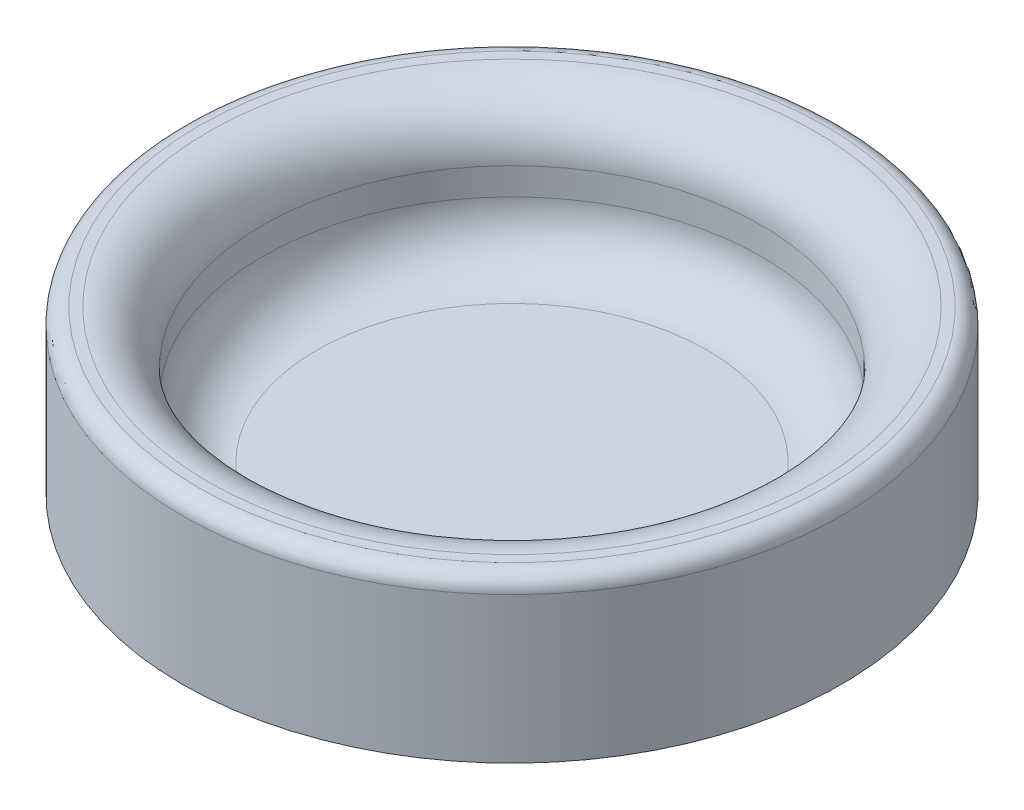
ISO-10303-21;
HEADER;
FILE_DESCRIPTION(('STEP AP214'),'2;1');
FILE_NAME('part.step','',(''),(''),'','','');
FILE_SCHEMA(('AUTOMOTIVE_DESIGN { 1 0 10303 214 1 1 1 1 }'));
ENDSEC;
DATA;
#1=APPLICATION_CONTEXT('core data for automotive mechanical design processes');
#2=APPLICATION_PROTOCOL_DEFINITION('international standard','automotive_design',2000,#1);
#3=PRODUCT_CONTEXT('',#1,'mechanical');
#4=PRODUCT('Part','Part','',(#3));
#5=PRODUCT_RELATED_PRODUCT_CATEGORY('part','',(#4));
#6=PRODUCT_DEFINITION_FORMATION('','',#4);
#7=PRODUCT_DEFINITION_CONTEXT('part definition',#1,'design');
#8=PRODUCT_DEFINITION('design','',#6,#7);
#9=PRODUCT_DEFINITION_SHAPE('','',#8);
#10=(LENGTH_UNIT() NAMED_UNIT(*) SI_UNIT(.MILLI.,.METRE.));
#11=(NAMED_UNIT(*) PLANE_ANGLE_UNIT() SI_UNIT($,.RADIAN.));
#12=(NAMED_UNIT(*) SI_UNIT($,.STERADIAN.) SOLID_ANGLE_UNIT());
#13=UNCERTAINTY_MEASURE_WITH_UNIT(LENGTH_MEASURE(1.E-05),#10,'distance_accuracy_value','');
#14=(GEOMETRIC_REPRESENTATION_CONTEXT(3) GLOBAL_UNCERTAINTY_ASSIGNED_CONTEXT((#13)) GLOBAL_UNIT_ASSIGNED_CONTEXT((#10,
#11,#12)) REPRESENTATION_CONTEXT('',''));
#15=CARTESIAN_POINT('',(0.,0.,0.));
#16=DIRECTION('',(0.,0.,1.));
#17=DIRECTION('',(1.,0.,0.));
#18=AXIS2_PLACEMENT_3D('',#15,#16,#17);
#19=CARTESIAN_POINT('',(-18.5585838996368,5.,-19.0375150970468));
#20=DIRECTION('',(0.,-1.,0.));
#21=DIRECTION('',(0.,0.,-1.));
#22=AXIS2_PLACEMENT_3D('',#19,#20,#21);
#23=CYLINDRICAL_SURFACE('',#22,60.9579895338705);
#24=CARTESIAN_POINT('',(-18.5585838996368,27.,-19.0375150970468));
#25=DIRECTION('',(0.,1.,0.));
#26=DIRECTION('',(0.,0.,1.));
#27=AXIS2_PLACEMENT_3D('',#24,#25,#26);
#28=CIRCLE('',#27,60.9579895338705);
#29=CARTESIAN_POINT('',(-18.5585838996368,27.,41.9204744368237));
#30=VERTEX_POINT('',#29);
#31=EDGE_CURVE('E11',#30,#30,#28,.F.);
#32=ORIENTED_EDGE('',*,*,#31,.T.);
#33=EDGE_LOOP('',(#32));
#34=FACE_BOUND('',#33,.T.);
#35=CARTESIAN_POINT('',(-18.5585838996368,0.,-19.0375150970468));
#36=DIRECTION('',(0.,1.,0.));
#37=DIRECTION('',(0.,0.,1.));
#38=AXIS2_PLACEMENT_3D('',#35,#36,#37);
#39=CIRCLE('',#38,60.9579895338705);
#40=CARTESIAN_POINT('',(-18.5585838996368,0.,41.9204744368237));
#41=VERTEX_POINT('',#40);
#42=EDGE_CURVE('E69',#41,#41,#39,.T.);
#43=ORIENTED_EDGE('',*,*,#42,.T.);
#44=EDGE_LOOP('',(#43));
#45=FACE_BOUND('',#44,.T.);
#46=ADVANCED_FACE('F43',(#34,#45),#23,.T.);
#47=CARTESIAN_POINT('',(0.,0.,0.));
#48=DIRECTION('',(0.,1.,0.));
#49=DIRECTION('',(0.,0.,1.));
#50=AXIS2_PLACEMENT_3D('',#47,#48,#49);
#51=PLANE('',#50);
#52=ORIENTED_EDGE('',*,*,#42,.F.);
#53=EDGE_LOOP('',(#52));
#54=FACE_BOUND('',#53,.T.);
#55=ADVANCED_FACE('F74',(#54),#51,.F.);
#56=CARTESIAN_POINT('',(-18.5585838996368,30.,-19.0375150970468));
#57=DIRECTION('',(0.,1.,0.));
#58=DIRECTION('',(0.,0.,1.));
#59=AXIS2_PLACEMENT_3D('',#56,#57,#58);
#60=PLANE('',#59);
#61=CARTESIAN_POINT('',(-18.5585838996368,30.,-19.0375150970468));
#62=DIRECTION('',(0.,1.,0.));
#63=DIRECTION('',(0.,0.,1.));
#64=AXIS2_PLACEMENT_3D('',#61,#62,#63);
#65=CIRCLE('',#64,57.9579895338705);
#66=CARTESIAN_POINT('',(-18.5585838996368,30.,38.9204744368237));
#67=VERTEX_POINT('',#66);
#68=EDGE_CURVE('E50',#67,#67,#65,.T.);
#69=ORIENTED_EDGE('',*,*,#68,.T.);
#70=EDGE_LOOP('',(#69));
#71=FACE_BOUND('',#70,.T.);
#72=CARTESIAN_POINT('',(-18.5585838996368,30.,-19.0375150970468));
#73=DIRECTION('',(0.,1.,0.));
#74=DIRECTION('',(0.,0.,1.));
#75=AXIS2_PLACEMENT_3D('',#72,#73,#74);
#76=CIRCLE('',#75,56.1321013405474);
#77=CARTESIAN_POINT('',(-18.5585838996368,30.,37.0945862435005));
#78=VERTEX_POINT('',#77);
#79=EDGE_CURVE('E54',#78,#78,#76,.F.);
#80=ORIENTED_EDGE('',*,*,#79,.T.);
#81=EDGE_LOOP('',(#80));
#82=FACE_BOUND('',#81,.T.);
#83=ADVANCED_FACE('F76',(#71,#82),#60,.T.);
#84=CARTESIAN_POINT('',(-18.5585838996368,30.,-19.0375150970468));
#85=DIRECTION('',(0.,-1.,0.));
#86=DIRECTION('',(0.,0.,-1.));
#87=AXIS2_PLACEMENT_3D('',#84,#85,#86);
#88=CYLINDRICAL_SURFACE('',#87,46.1321013405474);
#89=CARTESIAN_POINT('',(-18.5585838996368,20.,-19.0375150970468));
#90=DIRECTION('',(0.,1.,0.));
#91=DIRECTION('',(0.,0.,1.));
#92=AXIS2_PLACEMENT_3D('',#89,#90,#91);
#93=CIRCLE('',#92,46.1321013405474);
#94=CARTESIAN_POINT('',(-18.5585838996368,20.,27.0945862435005));
#95=VERTEX_POINT('',#94);
#96=EDGE_CURVE('E58',#95,#95,#93,.T.);
#97=ORIENTED_EDGE('',*,*,#96,.T.);
#98=EDGE_LOOP('',(#97));
#99=FACE_BOUND('',#98,.T.);
#100=CARTESIAN_POINT('',(-18.5585838996368,15.,-19.0375150970468));
#101=DIRECTION('',(0.,1.,0.));
#102=DIRECTION('',(0.,0.,1.));
#103=AXIS2_PLACEMENT_3D('',#100,#101,#102);
#104=CIRCLE('',#103,46.1321013405474);
#105=CARTESIAN_POINT('',(-18.5585838996368,15.,27.0945862435005));
#106=VERTEX_POINT('',#105);
#107=EDGE_CURVE('E66',#106,#106,#104,.F.);
#108=ORIENTED_EDGE('',*,*,#107,.T.);
#109=EDGE_LOOP('',(#108));
#110=FACE_BOUND('',#109,.T.);
#111=ADVANCED_FACE('F82',(#99,#110),#88,.F.);
#112=CARTESIAN_POINT('',(0.,5.,0.));
#113=DIRECTION('',(0.,1.,0.));
#114=DIRECTION('',(0.,0.,1.));
#115=AXIS2_PLACEMENT_3D('',#112,#113,#114);
#116=PLANE('',#115);
#117=CARTESIAN_POINT('',(-18.5585838996368,5.,-19.0375150970468));
#118=DIRECTION('',(0.,1.,0.));
#119=DIRECTION('',(0.,0.,1.));
#120=AXIS2_PLACEMENT_3D('',#117,#118,#119);
#121=CIRCLE('',#120,36.1321013405473);
#122=CARTESIAN_POINT('',(-18.5585838996368,5.,17.0945862435005));
#123=VERTEX_POINT('',#122);
#124=EDGE_CURVE('E63',#123,#123,#121,.T.);
#125=ORIENTED_EDGE('',*,*,#124,.T.);
#126=EDGE_LOOP('',(#125));
#127=FACE_BOUND('',#126,.T.);
#128=ADVANCED_FACE('F86',(#127),#116,.T.);
#129=CARTESIAN_POINT('',(-18.5585838996368,15.,-19.0375150970468));
#130=DIRECTION('',(0.,1.,0.));
#131=DIRECTION('',(0.,0.,1.));
#132=AXIS2_PLACEMENT_3D('',#129,#130,#131);
#133=TOROIDAL_SURFACE('',#132,36.1321013405473,10.);
#134=ORIENTED_EDGE('',*,*,#124,.F.);
#135=EDGE_LOOP('',(#134));
#136=FACE_BOUND('',#135,.T.);
#137=ORIENTED_EDGE('',*,*,#107,.F.);
#138=EDGE_LOOP('',(#137));
#139=FACE_BOUND('',#138,.T.);
#140=ADVANCED_FACE('F88',(#136,#139),#133,.F.);
#141=CARTESIAN_POINT('',(-18.5585838996368,20.,-19.0375150970468));
#142=DIRECTION('',(0.,1.,0.));
#143=DIRECTION('',(0.,0.,1.));
#144=AXIS2_PLACEMENT_3D('',#141,#142,#143);
#145=TOROIDAL_SURFACE('',#144,56.1321013405474,10.);
#146=ORIENTED_EDGE('',*,*,#79,.F.);
#147=EDGE_LOOP('',(#146));
#148=FACE_BOUND('',#147,.T.);
#149=ORIENTED_EDGE('',*,*,#96,.F.);
#150=EDGE_LOOP('',(#149));
#151=FACE_BOUND('',#150,.T.);
#152=ADVANCED_FACE('F90',(#148,#151),#145,.T.);
#153=CARTESIAN_POINT('',(-18.5585838996368,27.,-19.0375150970468));
#154=DIRECTION('',(0.,1.,0.));
#155=DIRECTION('',(0.,0.,1.));
#156=AXIS2_PLACEMENT_3D('',#153,#154,#155);
#157=TOROIDAL_SURFACE('',#156,57.9579895338705,3.);
#158=ORIENTED_EDGE('',*,*,#31,.F.);
#159=EDGE_LOOP('',(#158));
#160=FACE_BOUND('',#159,.T.);
#161=ORIENTED_EDGE('',*,*,#68,.F.);
#162=EDGE_LOOP('',(#161));
#163=FACE_BOUND('',#162,.T.);
#164=ADVANCED_FACE('F45',(#160,#163),#157,.T.);
#165=CLOSED_SHELL('',(#46,#55,#83,#111,#128,#140,#152,#164));
#166=MANIFOLD_SOLID_BREP('B2',#165);
#167=ADVANCED_BREP_SHAPE_REPRESENTATION('',(#18,#166),#14);
#168=SHAPE_DEFINITION_REPRESENTATION(#9,#167);
ENDSEC;
END-ISO-10303-21;
